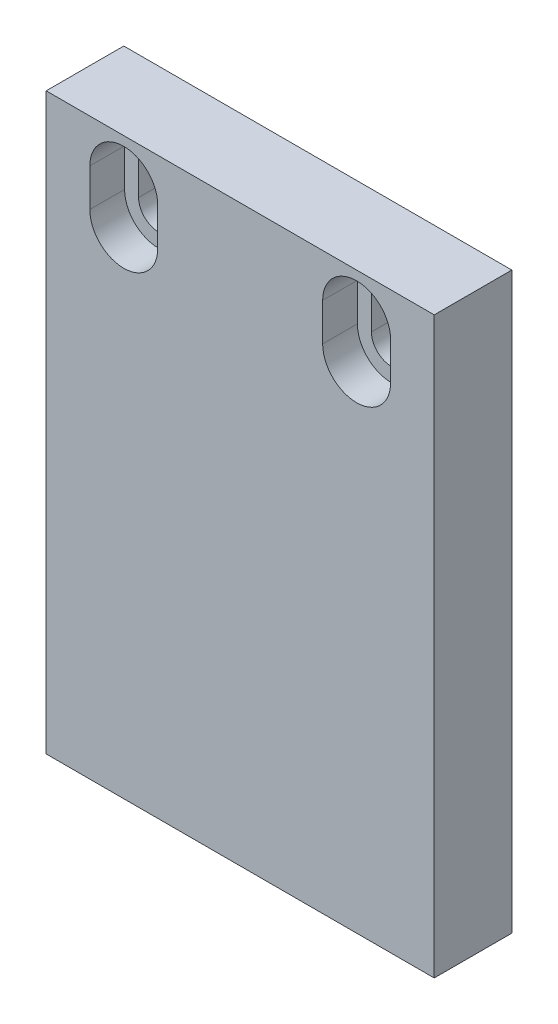
ISO-10303-21;
HEADER;
FILE_DESCRIPTION(('STEP AP214'),'2;1');
FILE_NAME('part.step','',(''),(''),'','','');
FILE_SCHEMA(('AUTOMOTIVE_DESIGN { 1 0 10303 214 1 1 1 1 }'));
ENDSEC;
DATA;
#1=APPLICATION_CONTEXT('core data for automotive mechanical design processes');
#2=APPLICATION_PROTOCOL_DEFINITION('international standard','automotive_design',2000,#1);
#3=PRODUCT_CONTEXT('',#1,'mechanical');
#4=PRODUCT('Part','Part','',(#3));
#5=PRODUCT_RELATED_PRODUCT_CATEGORY('part','',(#4));
#6=PRODUCT_DEFINITION_FORMATION('','',#4);
#7=PRODUCT_DEFINITION_CONTEXT('part definition',#1,'design');
#8=PRODUCT_DEFINITION('design','',#6,#7);
#9=PRODUCT_DEFINITION_SHAPE('','',#8);
#10=(LENGTH_UNIT() NAMED_UNIT(*) SI_UNIT(.MILLI.,.METRE.));
#11=(NAMED_UNIT(*) PLANE_ANGLE_UNIT() SI_UNIT($,.RADIAN.));
#12=(NAMED_UNIT(*) SI_UNIT($,.STERADIAN.) SOLID_ANGLE_UNIT());
#13=UNCERTAINTY_MEASURE_WITH_UNIT(LENGTH_MEASURE(1.E-05),#10,'distance_accuracy_value','');
#14=(GEOMETRIC_REPRESENTATION_CONTEXT(3) GLOBAL_UNCERTAINTY_ASSIGNED_CONTEXT((#13)) GLOBAL_UNIT_ASSIGNED_CONTEXT((#10,
#11,#12)) REPRESENTATION_CONTEXT('',''));
#15=CARTESIAN_POINT('',(0.,0.,0.));
#16=DIRECTION('',(0.,0.,1.));
#17=DIRECTION('',(1.,0.,0.));
#18=AXIS2_PLACEMENT_3D('',#15,#16,#17);
#19=CARTESIAN_POINT('',(15.875,46.99,3.175));
#20=DIRECTION('',(-1.,0.,0.));
#21=DIRECTION('',(0.,0.,1.));
#22=AXIS2_PLACEMENT_3D('',#19,#20,#21);
#23=PLANE('',#22);
#24=DIRECTION('',(0.,0.,-1.));
#25=VECTOR('',#24,1.);
#26=CARTESIAN_POINT('',(15.875,0.,3.175));
#27=LINE('',#26,#25);
#28=CARTESIAN_POINT('',(15.875,0.,3.175));
#29=VERTEX_POINT('',#28);
#30=CARTESIAN_POINT('',(15.875,0.,-3.175));
#31=VERTEX_POINT('',#30);
#32=EDGE_CURVE('E441',#29,#31,#27,.T.);
#33=ORIENTED_EDGE('',*,*,#32,.T.);
#34=DIRECTION('',(0.,-1.,0.));
#35=VECTOR('',#34,1.);
#36=CARTESIAN_POINT('',(15.875,46.99,-3.175));
#37=LINE('',#36,#35);
#38=CARTESIAN_POINT('',(15.875,46.99,-3.175));
#39=VERTEX_POINT('',#38);
#40=EDGE_CURVE('E470',#39,#31,#37,.T.);
#41=ORIENTED_EDGE('',*,*,#40,.F.);
#42=DIRECTION('',(0.,0.,-1.));
#43=VECTOR('',#42,1.);
#44=CARTESIAN_POINT('',(15.875,46.99,3.175));
#45=LINE('',#44,#43);
#46=CARTESIAN_POINT('',(15.875,46.99,3.175));
#47=VERTEX_POINT('',#46);
#48=EDGE_CURVE('E442',#47,#39,#45,.T.);
#49=ORIENTED_EDGE('',*,*,#48,.F.);
#50=DIRECTION('',(0.,-1.,0.));
#51=VECTOR('',#50,1.);
#52=CARTESIAN_POINT('',(15.875,46.99,3.175));
#53=LINE('',#52,#51);
#54=EDGE_CURVE('E454',#47,#29,#53,.T.);
#55=ORIENTED_EDGE('',*,*,#54,.T.);
#56=EDGE_LOOP('',(#33,#41,#49,#55));
#57=FACE_BOUND('',#56,.T.);
#58=ADVANCED_FACE('F185',(#57),#23,.F.);
#59=CARTESIAN_POINT('',(15.875,46.99,-3.175));
#60=DIRECTION('',(0.,0.,1.));
#61=DIRECTION('',(1.,0.,0.));
#62=AXIS2_PLACEMENT_3D('',#59,#60,#61);
#63=PLANE('',#62);
#64=CARTESIAN_POINT('',(9.525,40.36695,-3.175));
#65=DIRECTION('',(0.,0.,1.));
#66=DIRECTION('',(1.,0.,0.));
#67=AXIS2_PLACEMENT_3D('',#64,#65,#66);
#68=CIRCLE('',#67,1.63195);
#69=CARTESIAN_POINT('',(7.89305,40.36695,-3.175));
#70=VERTEX_POINT('',#69);
#71=CARTESIAN_POINT('',(11.15695,40.36695,-3.175));
#72=VERTEX_POINT('',#71);
#73=EDGE_CURVE('E192',#70,#72,#68,.T.);
#74=ORIENTED_EDGE('',*,*,#73,.T.);
#75=DIRECTION('',(0.,1.,0.));
#76=VECTOR('',#75,1.);
#77=CARTESIAN_POINT('',(11.15695,46.99,-3.175));
#78=LINE('',#77,#76);
#79=CARTESIAN_POINT('',(11.15695,43.45305,-3.175));
#80=VERTEX_POINT('',#79);
#81=EDGE_CURVE('E13',#72,#80,#78,.T.);
#82=ORIENTED_EDGE('',*,*,#81,.T.);
#83=CARTESIAN_POINT('',(9.525,43.45305,-3.175));
#84=DIRECTION('',(0.,0.,1.));
#85=DIRECTION('',(1.,0.,0.));
#86=AXIS2_PLACEMENT_3D('',#83,#84,#85);
#87=CIRCLE('',#86,1.63195);
#88=CARTESIAN_POINT('',(7.89305,43.45305,-3.175));
#89=VERTEX_POINT('',#88);
#90=EDGE_CURVE('E488',#80,#89,#87,.T.);
#91=ORIENTED_EDGE('',*,*,#90,.T.);
#92=DIRECTION('',(0.,-1.,0.));
#93=VECTOR('',#92,1.);
#94=CARTESIAN_POINT('',(7.89305,46.99,-3.175));
#95=LINE('',#94,#93);
#96=EDGE_CURVE('E485',#89,#70,#95,.T.);
#97=ORIENTED_EDGE('',*,*,#96,.T.);
#98=EDGE_LOOP('',(#74,#82,#91,#97));
#99=FACE_BOUND('',#98,.T.);
#100=CARTESIAN_POINT('',(-9.52500000000001,43.45305,-3.175));
#101=DIRECTION('',(0.,0.,1.));
#102=DIRECTION('',(1.,0.,0.));
#103=AXIS2_PLACEMENT_3D('',#100,#101,#102);
#104=CIRCLE('',#103,1.63195);
#105=CARTESIAN_POINT('',(-7.89305000000001,43.45305,-3.175));
#106=VERTEX_POINT('',#105);
#107=CARTESIAN_POINT('',(-11.15695,43.45305,-3.175));
#108=VERTEX_POINT('',#107);
#109=EDGE_CURVE('E479',#106,#108,#104,.T.);
#110=ORIENTED_EDGE('',*,*,#109,.T.);
#111=DIRECTION('',(0.,-1.,0.));
#112=VECTOR('',#111,1.);
#113=CARTESIAN_POINT('',(-11.15695,46.99,-3.175));
#114=LINE('',#113,#112);
#115=CARTESIAN_POINT('',(-11.15695,40.36695,-3.175));
#116=VERTEX_POINT('',#115);
#117=EDGE_CURVE('E482',#108,#116,#114,.T.);
#118=ORIENTED_EDGE('',*,*,#117,.T.);
#119=CARTESIAN_POINT('',(-9.52500000000001,40.36695,-3.175));
#120=DIRECTION('',(0.,0.,1.));
#121=DIRECTION('',(1.,0.,0.));
#122=AXIS2_PLACEMENT_3D('',#119,#120,#121);
#123=CIRCLE('',#122,1.63195);
#124=CARTESIAN_POINT('',(-7.89305000000001,40.36695,-3.175));
#125=VERTEX_POINT('',#124);
#126=EDGE_CURVE('E476',#116,#125,#123,.T.);
#127=ORIENTED_EDGE('',*,*,#126,.T.);
#128=DIRECTION('',(0.,1.,0.));
#129=VECTOR('',#128,1.);
#130=CARTESIAN_POINT('',(-7.89305000000001,46.99,-3.175));
#131=LINE('',#130,#129);
#132=EDGE_CURVE('E473',#125,#106,#131,.T.);
#133=ORIENTED_EDGE('',*,*,#132,.T.);
#134=EDGE_LOOP('',(#110,#118,#127,#133));
#135=FACE_BOUND('',#134,.T.);
#136=DIRECTION('',(-1.,0.,0.));
#137=VECTOR('',#136,1.);
#138=CARTESIAN_POINT('',(15.875,0.,-3.175));
#139=LINE('',#138,#137);
#140=CARTESIAN_POINT('',(-15.875,0.,-3.175));
#141=VERTEX_POINT('',#140);
#142=EDGE_CURVE('E457',#31,#141,#139,.T.);
#143=ORIENTED_EDGE('',*,*,#142,.T.);
#144=DIRECTION('',(0.,-1.,0.));
#145=VECTOR('',#144,1.);
#146=CARTESIAN_POINT('',(-15.875,46.99,-3.175));
#147=LINE('',#146,#145);
#148=CARTESIAN_POINT('',(-15.875,46.99,-3.175));
#149=VERTEX_POINT('',#148);
#150=EDGE_CURVE('E468',#149,#141,#147,.T.);
#151=ORIENTED_EDGE('',*,*,#150,.F.);
#152=DIRECTION('',(-1.,0.,0.));
#153=VECTOR('',#152,1.);
#154=CARTESIAN_POINT('',(15.875,46.99,-3.175));
#155=LINE('',#154,#153);
#156=EDGE_CURVE('E445',#39,#149,#155,.T.);
#157=ORIENTED_EDGE('',*,*,#156,.F.);
#158=ORIENTED_EDGE('',*,*,#40,.T.);
#159=EDGE_LOOP('',(#143,#151,#157,#158));
#160=FACE_BOUND('',#159,.T.);
#161=ADVANCED_FACE('F492',(#99,#135,#160),#63,.F.);
#162=CARTESIAN_POINT('',(-15.875,46.99,3.175));
#163=DIRECTION('',(-1.,0.,0.));
#164=DIRECTION('',(0.,0.,1.));
#165=AXIS2_PLACEMENT_3D('',#162,#163,#164);
#166=PLANE('',#165);
#167=DIRECTION('',(0.,0.,-1.));
#168=VECTOR('',#167,1.);
#169=CARTESIAN_POINT('',(-15.875,0.,3.175));
#170=LINE('',#169,#168);
#171=CARTESIAN_POINT('',(-15.875,0.,3.175));
#172=VERTEX_POINT('',#171);
#173=EDGE_CURVE('E460',#172,#141,#170,.T.);
#174=ORIENTED_EDGE('',*,*,#173,.F.);
#175=DIRECTION('',(0.,-1.,0.));
#176=VECTOR('',#175,1.);
#177=CARTESIAN_POINT('',(-15.875,46.99,3.175));
#178=LINE('',#177,#176);
#179=CARTESIAN_POINT('',(-15.875,46.99,3.175));
#180=VERTEX_POINT('',#179);
#181=EDGE_CURVE('E466',#180,#172,#178,.T.);
#182=ORIENTED_EDGE('',*,*,#181,.F.);
#183=DIRECTION('',(0.,0.,-1.));
#184=VECTOR('',#183,1.);
#185=CARTESIAN_POINT('',(-15.875,46.99,3.175));
#186=LINE('',#185,#184);
#187=EDGE_CURVE('E448',#180,#149,#186,.T.);
#188=ORIENTED_EDGE('',*,*,#187,.T.);
#189=ORIENTED_EDGE('',*,*,#150,.T.);
#190=EDGE_LOOP('',(#174,#182,#188,#189));
#191=FACE_BOUND('',#190,.T.);
#192=ADVANCED_FACE('F533',(#191),#166,.T.);
#193=CARTESIAN_POINT('',(15.875,46.99,3.175));
#194=DIRECTION('',(0.,0.,1.));
#195=DIRECTION('',(1.,0.,0.));
#196=AXIS2_PLACEMENT_3D('',#193,#194,#195);
#197=PLANE('',#196);
#198=DIRECTION('',(0.,1.,0.));
#199=VECTOR('',#198,1.);
#200=CARTESIAN_POINT('',(12.3037600000001,40.36695,3.175));
#201=LINE('',#200,#199);
#202=CARTESIAN_POINT('',(12.30376,40.36695,3.175));
#203=VERTEX_POINT('',#202);
#204=CARTESIAN_POINT('',(12.3037600000001,43.45305,3.175));
#205=VERTEX_POINT('',#204);
#206=EDGE_CURVE('E348',#203,#205,#201,.T.);
#207=ORIENTED_EDGE('',*,*,#206,.F.);
#208=CARTESIAN_POINT('',(9.525,40.36695,3.175));
#209=DIRECTION('',(0.,0.,1.));
#210=DIRECTION('',(1.,0.,0.));
#211=AXIS2_PLACEMENT_3D('',#208,#209,#210);
#212=CIRCLE('',#211,2.77876);
#213=CARTESIAN_POINT('',(6.74623999999996,40.36695,3.175));
#214=VERTEX_POINT('',#213);
#215=EDGE_CURVE('E337',#214,#203,#212,.T.);
#216=ORIENTED_EDGE('',*,*,#215,.F.);
#217=DIRECTION('',(0.,1.,0.));
#218=VECTOR('',#217,1.);
#219=CARTESIAN_POINT('',(6.74624,40.36695,3.175));
#220=LINE('',#219,#218);
#221=CARTESIAN_POINT('',(6.74624,43.45305,3.175));
#222=VERTEX_POINT('',#221);
#223=EDGE_CURVE('E356',#214,#222,#220,.T.);
#224=ORIENTED_EDGE('',*,*,#223,.T.);
#225=CARTESIAN_POINT('',(9.525,43.45305,3.175));
#226=DIRECTION('',(0.,0.,1.));
#227=DIRECTION('',(1.,0.,0.));
#228=AXIS2_PLACEMENT_3D('',#225,#226,#227);
#229=CIRCLE('',#228,2.77876);
#230=EDGE_CURVE('E369',#205,#222,#229,.T.);
#231=ORIENTED_EDGE('',*,*,#230,.F.);
#232=EDGE_LOOP('',(#207,#216,#224,#231));
#233=FACE_BOUND('',#232,.T.);
#234=CARTESIAN_POINT('',(-9.52500000000001,40.36695,3.175));
#235=DIRECTION('',(0.,0.,1.));
#236=DIRECTION('',(1.,0.,0.));
#237=AXIS2_PLACEMENT_3D('',#234,#235,#236);
#238=CIRCLE('',#237,2.77876);
#239=CARTESIAN_POINT('',(-12.3037600000001,40.36695,3.175));
#240=VERTEX_POINT('',#239);
#241=CARTESIAN_POINT('',(-6.74624000000001,40.36695,3.175));
#242=VERTEX_POINT('',#241);
#243=EDGE_CURVE('E403',#240,#242,#238,.T.);
#244=ORIENTED_EDGE('',*,*,#243,.F.);
#245=DIRECTION('',(0.,1.,0.));
#246=VECTOR('',#245,1.);
#247=CARTESIAN_POINT('',(-12.30376,40.36695,3.175));
#248=LINE('',#247,#246);
#249=CARTESIAN_POINT('',(-12.30376,43.45305,3.175));
#250=VERTEX_POINT('',#249);
#251=EDGE_CURVE('E391',#240,#250,#248,.T.);
#252=ORIENTED_EDGE('',*,*,#251,.T.);
#253=CARTESIAN_POINT('',(-9.52500000000001,43.45305,3.175));
#254=DIRECTION('',(0.,0.,1.));
#255=DIRECTION('',(1.,0.,0.));
#256=AXIS2_PLACEMENT_3D('',#253,#254,#255);
#257=CIRCLE('',#256,2.77876);
#258=CARTESIAN_POINT('',(-6.74624000000001,43.45305,3.175));
#259=VERTEX_POINT('',#258);
#260=EDGE_CURVE('E418',#259,#250,#257,.T.);
#261=ORIENTED_EDGE('',*,*,#260,.F.);
#262=DIRECTION('',(0.,1.,0.));
#263=VECTOR('',#262,1.);
#264=CARTESIAN_POINT('',(-6.74624000000001,40.36695,3.175));
#265=LINE('',#264,#263);
#266=EDGE_CURVE('E379',#242,#259,#265,.T.);
#267=ORIENTED_EDGE('',*,*,#266,.F.);
#268=EDGE_LOOP('',(#244,#252,#261,#267));
#269=FACE_BOUND('',#268,.T.);
#270=DIRECTION('',(-1.,0.,0.));
#271=VECTOR('',#270,1.);
#272=CARTESIAN_POINT('',(15.875,0.,3.175));
#273=LINE('',#272,#271);
#274=EDGE_CURVE('E446',#29,#172,#273,.T.);
#275=ORIENTED_EDGE('',*,*,#274,.F.);
#276=ORIENTED_EDGE('',*,*,#54,.F.);
#277=DIRECTION('',(-1.,0.,0.));
#278=VECTOR('',#277,1.);
#279=CARTESIAN_POINT('',(15.875,46.99,3.175));
#280=LINE('',#279,#278);
#281=EDGE_CURVE('E451',#47,#180,#280,.T.);
#282=ORIENTED_EDGE('',*,*,#281,.T.);
#283=ORIENTED_EDGE('',*,*,#181,.T.);
#284=EDGE_LOOP('',(#275,#276,#282,#283));
#285=FACE_BOUND('',#284,.T.);
#286=ADVANCED_FACE('F511',(#233,#269,#285),#197,.T.);
#287=CARTESIAN_POINT('',(0.,46.99,0.));
#288=DIRECTION('',(0.,1.,0.));
#289=DIRECTION('',(0.,0.,1.));
#290=AXIS2_PLACEMENT_3D('',#287,#288,#289);
#291=PLANE('',#290);
#292=ORIENTED_EDGE('',*,*,#48,.T.);
#293=ORIENTED_EDGE('',*,*,#156,.T.);
#294=ORIENTED_EDGE('',*,*,#187,.F.);
#295=ORIENTED_EDGE('',*,*,#281,.F.);
#296=EDGE_LOOP('',(#292,#293,#294,#295));
#297=FACE_BOUND('',#296,.T.);
#298=ADVANCED_FACE('F548',(#297),#291,.T.);
#299=CARTESIAN_POINT('',(0.,0.,0.));
#300=DIRECTION('',(0.,1.,0.));
#301=DIRECTION('',(0.,0.,1.));
#302=AXIS2_PLACEMENT_3D('',#299,#300,#301);
#303=PLANE('',#302);
#304=CARTESIAN_POINT('',(-9.52499999999999,0.,0.));
#305=DIRECTION('',(0.,-1.,0.));
#306=DIRECTION('',(0.,0.,-1.));
#307=AXIS2_PLACEMENT_3D('',#304,#305,#306);
#308=CIRCLE('',#307,1.1303);
#309=CARTESIAN_POINT('',(-9.52499999999999,0.,-1.1303));
#310=VERTEX_POINT('',#309);
#311=EDGE_CURVE('E429',#310,#310,#308,.T.);
#312=ORIENTED_EDGE('',*,*,#311,.F.);
#313=EDGE_LOOP('',(#312));
#314=FACE_BOUND('',#313,.T.);
#315=CARTESIAN_POINT('',(9.525,0.,0.));
#316=DIRECTION('',(0.,-1.,0.));
#317=DIRECTION('',(0.,0.,-1.));
#318=AXIS2_PLACEMENT_3D('',#315,#316,#317);
#319=CIRCLE('',#318,1.1303);
#320=CARTESIAN_POINT('',(9.525,0.,-1.1303));
#321=VERTEX_POINT('',#320);
#322=EDGE_CURVE('E435',#321,#321,#319,.T.);
#323=ORIENTED_EDGE('',*,*,#322,.F.);
#324=EDGE_LOOP('',(#323));
#325=FACE_BOUND('',#324,.T.);
#326=ORIENTED_EDGE('',*,*,#32,.F.);
#327=ORIENTED_EDGE('',*,*,#274,.T.);
#328=ORIENTED_EDGE('',*,*,#173,.T.);
#329=ORIENTED_EDGE('',*,*,#142,.F.);
#330=EDGE_LOOP('',(#326,#327,#328,#329));
#331=FACE_BOUND('',#330,.T.);
#332=ADVANCED_FACE('F539',(#314,#325,#331),#303,.F.);
#333=CARTESIAN_POINT('',(9.525,7.5946,0.));
#334=DIRECTION('',(0.,-1.,0.));
#335=DIRECTION('',(0.,0.,-1.));
#336=AXIS2_PLACEMENT_3D('',#333,#334,#335);
#337=CONICAL_SURFACE('',#336,1.1303,1.02974425867665);
#338=CARTESIAN_POINT('',(9.525,8.27375275768685,0.));
#339=VERTEX_POINT('',#338);
#340=VERTEX_LOOP('',#339);
#341=FACE_BOUND('',#340,.T.);
#342=CARTESIAN_POINT('',(9.525,7.5946,0.));
#343=DIRECTION('',(0.,-1.,0.));
#344=DIRECTION('',(0.,0.,-1.));
#345=AXIS2_PLACEMENT_3D('',#342,#343,#344);
#346=CIRCLE('',#345,1.1303);
#347=CARTESIAN_POINT('',(9.525,7.5946,-1.1303));
#348=VERTEX_POINT('',#347);
#349=EDGE_CURVE('E438',#348,#348,#346,.T.);
#350=ORIENTED_EDGE('',*,*,#349,.T.);
#351=EDGE_LOOP('',(#350));
#352=FACE_BOUND('',#351,.T.);
#353=ADVANCED_FACE('F555',(#341,#352),#337,.F.);
#354=CARTESIAN_POINT('',(9.525,0.,0.));
#355=DIRECTION('',(0.,-1.,0.));
#356=DIRECTION('',(0.,0.,-1.));
#357=AXIS2_PLACEMENT_3D('',#354,#355,#356);
#358=CYLINDRICAL_SURFACE('',#357,1.1303);
#359=ORIENTED_EDGE('',*,*,#349,.F.);
#360=EDGE_LOOP('',(#359));
#361=FACE_BOUND('',#360,.T.);
#362=ORIENTED_EDGE('',*,*,#322,.T.);
#363=EDGE_LOOP('',(#362));
#364=FACE_BOUND('',#363,.T.);
#365=ADVANCED_FACE('F743',(#361,#364),#358,.F.);
#366=CARTESIAN_POINT('',(-9.52499999999999,7.5946,0.));
#367=DIRECTION('',(0.,-1.,0.));
#368=DIRECTION('',(0.,0.,-1.));
#369=AXIS2_PLACEMENT_3D('',#366,#367,#368);
#370=CONICAL_SURFACE('',#369,1.1303,1.02974425867665);
#371=CARTESIAN_POINT('',(-9.525,8.27375275768685,0.));
#372=VERTEX_POINT('',#371);
#373=VERTEX_LOOP('',#372);
#374=FACE_BOUND('',#373,.T.);
#375=CARTESIAN_POINT('',(-9.52499999999999,7.5946,0.));
#376=DIRECTION('',(0.,-1.,0.));
#377=DIRECTION('',(0.,0.,-1.));
#378=AXIS2_PLACEMENT_3D('',#375,#376,#377);
#379=CIRCLE('',#378,1.1303);
#380=CARTESIAN_POINT('',(-9.52499999999999,7.5946,-1.1303));
#381=VERTEX_POINT('',#380);
#382=EDGE_CURVE('E432',#381,#381,#379,.T.);
#383=ORIENTED_EDGE('',*,*,#382,.T.);
#384=EDGE_LOOP('',(#383));
#385=FACE_BOUND('',#384,.T.);
#386=ADVANCED_FACE('F740',(#374,#385),#370,.F.);
#387=CARTESIAN_POINT('',(-9.52499999999999,0.,0.));
#388=DIRECTION('',(0.,-1.,0.));
#389=DIRECTION('',(0.,0.,-1.));
#390=AXIS2_PLACEMENT_3D('',#387,#388,#389);
#391=CYLINDRICAL_SURFACE('',#390,1.1303);
#392=ORIENTED_EDGE('',*,*,#382,.F.);
#393=EDGE_LOOP('',(#392));
#394=FACE_BOUND('',#393,.T.);
#395=ORIENTED_EDGE('',*,*,#311,.T.);
#396=EDGE_LOOP('',(#395));
#397=FACE_BOUND('',#396,.T.);
#398=ADVANCED_FACE('F586',(#394,#397),#391,.F.);
#399=CARTESIAN_POINT('',(-11.15695,40.36695,3.175));
#400=DIRECTION('',(-1.,0.,0.));
#401=DIRECTION('',(0.,0.,1.));
#402=AXIS2_PLACEMENT_3D('',#399,#400,#401);
#403=PLANE('',#402);
#404=DIRECTION('',(0.,0.,1.));
#405=VECTOR('',#404,1.);
#406=CARTESIAN_POINT('',(-11.15695,43.45305,3.175));
#407=LINE('',#406,#405);
#408=CARTESIAN_POINT('',(-11.15695,43.45305,0.3302));
#409=VERTEX_POINT('',#408);
#410=EDGE_CURVE('E411',#108,#409,#407,.T.);
#411=ORIENTED_EDGE('',*,*,#410,.T.);
#412=DIRECTION('',(0.,1.,0.));
#413=VECTOR('',#412,1.);
#414=CARTESIAN_POINT('',(-11.15695,40.36695,0.3302));
#415=LINE('',#414,#413);
#416=CARTESIAN_POINT('',(-11.15695,40.36695,0.3302));
#417=VERTEX_POINT('',#416);
#418=EDGE_CURVE('E386',#417,#409,#415,.T.);
#419=ORIENTED_EDGE('',*,*,#418,.F.);
#420=DIRECTION('',(0.,0.,1.));
#421=VECTOR('',#420,1.);
#422=CARTESIAN_POINT('',(-11.15695,40.36695,3.175));
#423=LINE('',#422,#421);
#424=EDGE_CURVE('E394',#417,#116,#423,.F.);
#425=ORIENTED_EDGE('',*,*,#424,.T.);
#426=ORIENTED_EDGE('',*,*,#117,.F.);
#427=EDGE_LOOP('',(#411,#419,#425,#426));
#428=FACE_BOUND('',#427,.T.);
#429=ADVANCED_FACE('F580',(#428),#403,.F.);
#430=CARTESIAN_POINT('',(-9.52500000000001,43.45305,3.175));
#431=DIRECTION('',(0.,0.,1.));
#432=DIRECTION('',(1.,0.,0.));
#433=AXIS2_PLACEMENT_3D('',#430,#431,#432);
#434=CYLINDRICAL_SURFACE('',#433,1.63195);
#435=DIRECTION('',(0.,0.,-1.));
#436=VECTOR('',#435,1.);
#437=CARTESIAN_POINT('',(-7.89305000000001,43.45305,-13.335));
#438=LINE('',#437,#436);
#439=CARTESIAN_POINT('',(-7.89305000000001,43.45305,0.3302));
#440=VERTEX_POINT('',#439);
#441=EDGE_CURVE('E416',#440,#106,#438,.T.);
#442=ORIENTED_EDGE('',*,*,#441,.F.);
#443=CARTESIAN_POINT('',(-9.52500000000001,43.45305,0.3302));
#444=DIRECTION('',(0.,0.,1.));
#445=DIRECTION('',(1.,0.,0.));
#446=AXIS2_PLACEMENT_3D('',#443,#444,#445);
#447=CIRCLE('',#446,1.63195);
#448=EDGE_CURVE('E424',#440,#409,#447,.T.);
#449=ORIENTED_EDGE('',*,*,#448,.T.);
#450=ORIENTED_EDGE('',*,*,#410,.F.);
#451=ORIENTED_EDGE('',*,*,#109,.F.);
#452=EDGE_LOOP('',(#442,#449,#450,#451));
#453=FACE_BOUND('',#452,.T.);
#454=ADVANCED_FACE('F585',(#453),#434,.F.);
#455=CARTESIAN_POINT('',(-9.52500000000001,40.36695,3.175));
#456=DIRECTION('',(0.,0.,1.));
#457=DIRECTION('',(1.,0.,0.));
#458=AXIS2_PLACEMENT_3D('',#455,#456,#457);
#459=CYLINDRICAL_SURFACE('',#458,1.63195);
#460=ORIENTED_EDGE('',*,*,#424,.F.);
#461=CARTESIAN_POINT('',(-9.52500000000001,40.36695,0.3302));
#462=DIRECTION('',(0.,0.,1.));
#463=DIRECTION('',(1.,0.,0.));
#464=AXIS2_PLACEMENT_3D('',#461,#462,#463);
#465=CIRCLE('',#464,1.63195);
#466=CARTESIAN_POINT('',(-7.89305000000001,40.36695,0.3302));
#467=VERTEX_POINT('',#466);
#468=EDGE_CURVE('E407',#417,#467,#465,.T.);
#469=ORIENTED_EDGE('',*,*,#468,.T.);
#470=DIRECTION('',(0.,0.,-1.));
#471=VECTOR('',#470,1.);
#472=CARTESIAN_POINT('',(-7.89305000000001,40.36695,-13.335));
#473=LINE('',#472,#471);
#474=EDGE_CURVE('E400',#467,#125,#473,.T.);
#475=ORIENTED_EDGE('',*,*,#474,.T.);
#476=ORIENTED_EDGE('',*,*,#126,.F.);
#477=EDGE_LOOP('',(#460,#469,#475,#476));
#478=FACE_BOUND('',#477,.T.);
#479=ADVANCED_FACE('F598',(#478),#459,.F.);
#480=CARTESIAN_POINT('',(-7.89305000000001,40.36695,-13.335));
#481=DIRECTION('',(1.,0.,0.));
#482=DIRECTION('',(0.,0.,-1.));
#483=AXIS2_PLACEMENT_3D('',#480,#481,#482);
#484=PLANE('',#483);
#485=ORIENTED_EDGE('',*,*,#474,.F.);
#486=DIRECTION('',(0.,1.,0.));
#487=VECTOR('',#486,1.);
#488=CARTESIAN_POINT('',(-7.89305000000001,40.36695,0.3302));
#489=LINE('',#488,#487);
#490=EDGE_CURVE('E384',#467,#440,#489,.T.);
#491=ORIENTED_EDGE('',*,*,#490,.T.);
#492=ORIENTED_EDGE('',*,*,#441,.T.);
#493=ORIENTED_EDGE('',*,*,#132,.F.);
#494=EDGE_LOOP('',(#485,#491,#492,#493));
#495=FACE_BOUND('',#494,.T.);
#496=ADVANCED_FACE('F608',(#495),#484,.F.);
#497=CARTESIAN_POINT('',(-7.89305000000001,43.45305,0.3302));
#498=DIRECTION('',(0.,0.,-1.));
#499=DIRECTION('',(-1.,0.,0.));
#500=AXIS2_PLACEMENT_3D('',#497,#498,#499);
#501=PLANE('',#500);
#502=DIRECTION('',(0.,1.,0.));
#503=VECTOR('',#502,1.);
#504=CARTESIAN_POINT('',(-12.30376,40.36695,0.3302));
#505=LINE('',#504,#503);
#506=CARTESIAN_POINT('',(-12.30376,40.36695,0.3302));
#507=VERTEX_POINT('',#506);
#508=CARTESIAN_POINT('',(-12.30376,43.45305,0.3302));
#509=VERTEX_POINT('',#508);
#510=EDGE_CURVE('E389',#507,#509,#505,.T.);
#511=ORIENTED_EDGE('',*,*,#510,.F.);
#512=CARTESIAN_POINT('',(-9.52500000000001,40.36695,0.3302));
#513=DIRECTION('',(0.,0.,1.));
#514=DIRECTION('',(1.,0.,0.));
#515=AXIS2_PLACEMENT_3D('',#512,#513,#514);
#516=CIRCLE('',#515,2.77876);
#517=CARTESIAN_POINT('',(-6.74624000000001,40.36695,0.3302));
#518=VERTEX_POINT('',#517);
#519=EDGE_CURVE('E405',#507,#518,#516,.T.);
#520=ORIENTED_EDGE('',*,*,#519,.T.);
#521=DIRECTION('',(0.,1.,0.));
#522=VECTOR('',#521,1.);
#523=CARTESIAN_POINT('',(-6.74624000000001,40.36695,0.3302));
#524=LINE('',#523,#522);
#525=CARTESIAN_POINT('',(-6.74624000000001,43.45305,0.3302));
#526=VERTEX_POINT('',#525);
#527=EDGE_CURVE('E382',#518,#526,#524,.T.);
#528=ORIENTED_EDGE('',*,*,#527,.T.);
#529=CARTESIAN_POINT('',(-9.52500000000001,43.45305,0.3302));
#530=DIRECTION('',(0.,0.,1.));
#531=DIRECTION('',(1.,0.,0.));
#532=AXIS2_PLACEMENT_3D('',#529,#530,#531);
#533=CIRCLE('',#532,2.77876);
#534=EDGE_CURVE('E421',#526,#509,#533,.T.);
#535=ORIENTED_EDGE('',*,*,#534,.T.);
#536=EDGE_LOOP('',(#511,#520,#528,#535));
#537=FACE_BOUND('',#536,.T.);
#538=ORIENTED_EDGE('',*,*,#448,.F.);
#539=ORIENTED_EDGE('',*,*,#490,.F.);
#540=ORIENTED_EDGE('',*,*,#468,.F.);
#541=ORIENTED_EDGE('',*,*,#418,.T.);
#542=EDGE_LOOP('',(#538,#539,#540,#541));
#543=FACE_BOUND('',#542,.T.);
#544=ADVANCED_FACE('F618',(#537,#543),#501,.F.);
#545=CARTESIAN_POINT('',(-9.52500000000001,43.45305,3.175));
#546=DIRECTION('',(0.,0.,1.));
#547=DIRECTION('',(1.,0.,0.));
#548=AXIS2_PLACEMENT_3D('',#545,#546,#547);
#549=CYLINDRICAL_SURFACE('',#548,2.77876);
#550=ORIENTED_EDGE('',*,*,#534,.F.);
#551=DIRECTION('',(0.,0.,-1.));
#552=VECTOR('',#551,1.);
#553=CARTESIAN_POINT('',(-6.74624000000001,43.45305,0.3302));
#554=LINE('',#553,#552);
#555=EDGE_CURVE('E413',#259,#526,#554,.T.);
#556=ORIENTED_EDGE('',*,*,#555,.F.);
#557=ORIENTED_EDGE('',*,*,#260,.T.);
#558=DIRECTION('',(0.,0.,1.));
#559=VECTOR('',#558,1.);
#560=CARTESIAN_POINT('',(-12.30376,43.45305,3.175));
#561=LINE('',#560,#559);
#562=EDGE_CURVE('E427',#509,#250,#561,.T.);
#563=ORIENTED_EDGE('',*,*,#562,.F.);
#564=EDGE_LOOP('',(#550,#556,#557,#563));
#565=FACE_BOUND('',#564,.T.);
#566=ADVANCED_FACE('F628',(#565),#549,.F.);
#567=CARTESIAN_POINT('',(-9.52500000000001,40.36695,3.175));
#568=DIRECTION('',(0.,0.,1.));
#569=DIRECTION('',(1.,0.,0.));
#570=AXIS2_PLACEMENT_3D('',#567,#568,#569);
#571=CYLINDRICAL_SURFACE('',#570,2.77876);
#572=ORIENTED_EDGE('',*,*,#243,.T.);
#573=DIRECTION('',(0.,0.,-1.));
#574=VECTOR('',#573,1.);
#575=CARTESIAN_POINT('',(-6.74624000000001,40.36695,0.3302));
#576=LINE('',#575,#574);
#577=EDGE_CURVE('E397',#242,#518,#576,.T.);
#578=ORIENTED_EDGE('',*,*,#577,.T.);
#579=ORIENTED_EDGE('',*,*,#519,.F.);
#580=DIRECTION('',(0.,0.,1.));
#581=VECTOR('',#580,1.);
#582=CARTESIAN_POINT('',(-12.30376,40.36695,3.175));
#583=LINE('',#582,#581);
#584=EDGE_CURVE('E409',#240,#507,#583,.F.);
#585=ORIENTED_EDGE('',*,*,#584,.F.);
#586=EDGE_LOOP('',(#572,#578,#579,#585));
#587=FACE_BOUND('',#586,.T.);
#588=ADVANCED_FACE('F638',(#587),#571,.F.);
#589=CARTESIAN_POINT('',(-12.30376,40.36695,3.175));
#590=DIRECTION('',(-1.,0.,0.));
#591=DIRECTION('',(0.,0.,1.));
#592=AXIS2_PLACEMENT_3D('',#589,#590,#591);
#593=PLANE('',#592);
#594=ORIENTED_EDGE('',*,*,#562,.T.);
#595=ORIENTED_EDGE('',*,*,#251,.F.);
#596=ORIENTED_EDGE('',*,*,#584,.T.);
#597=ORIENTED_EDGE('',*,*,#510,.T.);
#598=EDGE_LOOP('',(#594,#595,#596,#597));
#599=FACE_BOUND('',#598,.T.);
#600=ADVANCED_FACE('F648',(#599),#593,.F.);
#601=CARTESIAN_POINT('',(-6.74624000000001,40.36695,0.3302));
#602=DIRECTION('',(1.,0.,0.));
#603=DIRECTION('',(0.,0.,-1.));
#604=AXIS2_PLACEMENT_3D('',#601,#602,#603);
#605=PLANE('',#604);
#606=ORIENTED_EDGE('',*,*,#555,.T.);
#607=ORIENTED_EDGE('',*,*,#527,.F.);
#608=ORIENTED_EDGE('',*,*,#577,.F.);
#609=ORIENTED_EDGE('',*,*,#266,.T.);
#610=EDGE_LOOP('',(#606,#607,#608,#609));
#611=FACE_BOUND('',#610,.T.);
#612=ADVANCED_FACE('F658',(#611),#605,.F.);
#613=CARTESIAN_POINT('',(9.525,40.36695,3.175));
#614=DIRECTION('',(0.,0.,1.));
#615=DIRECTION('',(1.,0.,0.));
#616=AXIS2_PLACEMENT_3D('',#613,#614,#615);
#617=CYLINDRICAL_SURFACE('',#616,1.63195);
#618=DIRECTION('',(0.,0.,1.));
#619=VECTOR('',#618,1.);
#620=CARTESIAN_POINT('',(7.89305,40.36695,3.175));
#621=LINE('',#620,#619);
#622=CARTESIAN_POINT('',(7.89305,40.36695,0.3302));
#623=VERTEX_POINT('',#622);
#624=EDGE_CURVE('E199',#623,#70,#621,.F.);
#625=ORIENTED_EDGE('',*,*,#624,.F.);
#626=CARTESIAN_POINT('',(9.525,40.36695,0.3302));
#627=DIRECTION('',(0.,0.,1.));
#628=DIRECTION('',(1.,0.,0.));
#629=AXIS2_PLACEMENT_3D('',#626,#627,#628);
#630=CIRCLE('',#629,1.63195);
#631=CARTESIAN_POINT('',(11.15695,40.36695,0.3302));
#632=VERTEX_POINT('',#631);
#633=EDGE_CURVE('E336',#623,#632,#630,.T.);
#634=ORIENTED_EDGE('',*,*,#633,.T.);
#635=DIRECTION('',(0.,0.,-1.));
#636=VECTOR('',#635,1.);
#637=CARTESIAN_POINT('',(11.15695,40.36695,-13.335));
#638=LINE('',#637,#636);
#639=EDGE_CURVE('E352',#632,#72,#638,.T.);
#640=ORIENTED_EDGE('',*,*,#639,.T.);
#641=ORIENTED_EDGE('',*,*,#73,.F.);
#642=EDGE_LOOP('',(#625,#634,#640,#641));
#643=FACE_BOUND('',#642,.T.);
#644=ADVANCED_FACE('F495',(#643),#617,.F.);
#645=CARTESIAN_POINT('',(9.525,43.45305,3.175));
#646=DIRECTION('',(0.,0.,1.));
#647=DIRECTION('',(1.,0.,0.));
#648=AXIS2_PLACEMENT_3D('',#645,#646,#647);
#649=CYLINDRICAL_SURFACE('',#648,1.63195);
#650=DIRECTION('',(0.,0.,-1.));
#651=VECTOR('',#650,1.);
#652=CARTESIAN_POINT('',(11.15695,43.45305,-13.335));
#653=LINE('',#652,#651);
#654=CARTESIAN_POINT('',(11.15695,43.45305,0.3302));
#655=VERTEX_POINT('',#654);
#656=EDGE_CURVE('E366',#655,#80,#653,.T.);
#657=ORIENTED_EDGE('',*,*,#656,.F.);
#658=CARTESIAN_POINT('',(9.525,43.45305,0.3302));
#659=DIRECTION('',(0.,0.,1.));
#660=DIRECTION('',(1.,0.,0.));
#661=AXIS2_PLACEMENT_3D('',#658,#659,#660);
#662=CIRCLE('',#661,1.63195);
#663=CARTESIAN_POINT('',(7.89305,43.45305,0.3302));
#664=VERTEX_POINT('',#663);
#665=EDGE_CURVE('E374',#655,#664,#662,.T.);
#666=ORIENTED_EDGE('',*,*,#665,.T.);
#667=DIRECTION('',(0.,0.,1.));
#668=VECTOR('',#667,1.);
#669=CARTESIAN_POINT('',(7.89305,43.45305,3.175));
#670=LINE('',#669,#668);
#671=EDGE_CURVE('E363',#89,#664,#670,.T.);
#672=ORIENTED_EDGE('',*,*,#671,.F.);
#673=ORIENTED_EDGE('',*,*,#90,.F.);
#674=EDGE_LOOP('',(#657,#666,#672,#673));
#675=FACE_BOUND('',#674,.T.);
#676=ADVANCED_FACE('F677',(#675),#649,.F.);
#677=CARTESIAN_POINT('',(11.15695,40.36695,-13.335));
#678=DIRECTION('',(1.,0.,0.));
#679=DIRECTION('',(0.,0.,-1.));
#680=AXIS2_PLACEMENT_3D('',#677,#678,#679);
#681=PLANE('',#680);
#682=ORIENTED_EDGE('',*,*,#639,.F.);
#683=DIRECTION('',(0.,1.,0.));
#684=VECTOR('',#683,1.);
#685=CARTESIAN_POINT('',(11.15695,40.36695,0.3302));
#686=LINE('',#685,#684);
#687=EDGE_CURVE('E347',#632,#655,#686,.T.);
#688=ORIENTED_EDGE('',*,*,#687,.T.);
#689=ORIENTED_EDGE('',*,*,#656,.T.);
#690=ORIENTED_EDGE('',*,*,#81,.F.);
#691=EDGE_LOOP('',(#682,#688,#689,#690));
#692=FACE_BOUND('',#691,.T.);
#693=ADVANCED_FACE('F499',(#692),#681,.F.);
#694=CARTESIAN_POINT('',(7.89305,40.36695,3.175));
#695=DIRECTION('',(-1.,0.,0.));
#696=DIRECTION('',(0.,0.,1.));
#697=AXIS2_PLACEMENT_3D('',#694,#695,#696);
#698=PLANE('',#697);
#699=ORIENTED_EDGE('',*,*,#671,.T.);
#700=DIRECTION('',(0.,1.,0.));
#701=VECTOR('',#700,1.);
#702=CARTESIAN_POINT('',(7.89305,40.36695,0.3302));
#703=LINE('',#702,#701);
#704=EDGE_CURVE('E503',#623,#664,#703,.T.);
#705=ORIENTED_EDGE('',*,*,#704,.F.);
#706=ORIENTED_EDGE('',*,*,#624,.T.);
#707=ORIENTED_EDGE('',*,*,#96,.F.);
#708=EDGE_LOOP('',(#699,#705,#706,#707));
#709=FACE_BOUND('',#708,.T.);
#710=ADVANCED_FACE('F525',(#709),#698,.F.);
#711=CARTESIAN_POINT('',(11.15695,43.45305,0.3302));
#712=DIRECTION('',(0.,0.,-1.));
#713=DIRECTION('',(-1.,0.,0.));
#714=AXIS2_PLACEMENT_3D('',#711,#712,#713);
#715=PLANE('',#714);
#716=DIRECTION('',(0.,1.,0.));
#717=VECTOR('',#716,1.);
#718=CARTESIAN_POINT('',(6.74624,40.36695,0.3302));
#719=LINE('',#718,#717);
#720=CARTESIAN_POINT('',(6.74624,40.36695,0.3302));
#721=VERTEX_POINT('',#720);
#722=CARTESIAN_POINT('',(6.74624,43.45305,0.3302));
#723=VERTEX_POINT('',#722);
#724=EDGE_CURVE('E334',#721,#723,#719,.T.);
#725=ORIENTED_EDGE('',*,*,#724,.F.);
#726=CARTESIAN_POINT('',(9.525,40.36695,0.3302));
#727=DIRECTION('',(0.,0.,1.));
#728=DIRECTION('',(1.,0.,0.));
#729=AXIS2_PLACEMENT_3D('',#726,#727,#728);
#730=CIRCLE('',#729,2.77876);
#731=CARTESIAN_POINT('',(12.30376,40.36695,0.3302));
#732=VERTEX_POINT('',#731);
#733=EDGE_CURVE('E327',#721,#732,#730,.T.);
#734=ORIENTED_EDGE('',*,*,#733,.T.);
#735=DIRECTION('',(0.,1.,0.));
#736=VECTOR('',#735,1.);
#737=CARTESIAN_POINT('',(12.30376,40.36695,0.3302));
#738=LINE('',#737,#736);
#739=CARTESIAN_POINT('',(12.30376,43.45305,0.3302));
#740=VERTEX_POINT('',#739);
#741=EDGE_CURVE('E332',#732,#740,#738,.T.);
#742=ORIENTED_EDGE('',*,*,#741,.T.);
#743=CARTESIAN_POINT('',(9.525,43.45305,0.3302));
#744=DIRECTION('',(0.,0.,1.));
#745=DIRECTION('',(1.,0.,0.));
#746=AXIS2_PLACEMENT_3D('',#743,#744,#745);
#747=CIRCLE('',#746,2.77876);
#748=EDGE_CURVE('E372',#740,#723,#747,.T.);
#749=ORIENTED_EDGE('',*,*,#748,.T.);
#750=EDGE_LOOP('',(#725,#734,#742,#749));
#751=FACE_BOUND('',#750,.T.);
#752=ORIENTED_EDGE('',*,*,#665,.F.);
#753=ORIENTED_EDGE('',*,*,#687,.F.);
#754=ORIENTED_EDGE('',*,*,#633,.F.);
#755=ORIENTED_EDGE('',*,*,#704,.T.);
#756=EDGE_LOOP('',(#752,#753,#754,#755));
#757=FACE_BOUND('',#756,.T.);
#758=ADVANCED_FACE('F329',(#751,#757),#715,.F.);
#759=CARTESIAN_POINT('',(9.525,43.45305,3.175));
#760=DIRECTION('',(0.,0.,1.));
#761=DIRECTION('',(1.,0.,0.));
#762=AXIS2_PLACEMENT_3D('',#759,#760,#761);
#763=CYLINDRICAL_SURFACE('',#762,2.77876);
#764=ORIENTED_EDGE('',*,*,#748,.F.);
#765=DIRECTION('',(0.,0.,-1.));
#766=VECTOR('',#765,1.);
#767=CARTESIAN_POINT('',(12.30376,43.45305,0.3302));
#768=LINE('',#767,#766);
#769=EDGE_CURVE('E346',#205,#740,#768,.T.);
#770=ORIENTED_EDGE('',*,*,#769,.F.);
#771=ORIENTED_EDGE('',*,*,#230,.T.);
#772=DIRECTION('',(0.,0.,1.));
#773=VECTOR('',#772,1.);
#774=CARTESIAN_POINT('',(6.74624,43.45305,3.175));
#775=LINE('',#774,#773);
#776=EDGE_CURVE('E377',#723,#222,#775,.T.);
#777=ORIENTED_EDGE('',*,*,#776,.F.);
#778=EDGE_LOOP('',(#764,#770,#771,#777));
#779=FACE_BOUND('',#778,.T.);
#780=ADVANCED_FACE('F517',(#779),#763,.F.);
#781=CARTESIAN_POINT('',(9.525,40.36695,3.175));
#782=DIRECTION('',(0.,0.,1.));
#783=DIRECTION('',(1.,0.,0.));
#784=AXIS2_PLACEMENT_3D('',#781,#782,#783);
#785=CYLINDRICAL_SURFACE('',#784,2.77876);
#786=ORIENTED_EDGE('',*,*,#215,.T.);
#787=DIRECTION('',(0.,0.,-1.));
#788=VECTOR('',#787,1.);
#789=CARTESIAN_POINT('',(12.30376,40.36695,0.3302));
#790=LINE('',#789,#788);
#791=EDGE_CURVE('E343',#203,#732,#790,.T.);
#792=ORIENTED_EDGE('',*,*,#791,.T.);
#793=ORIENTED_EDGE('',*,*,#733,.F.);
#794=DIRECTION('',(0.,0.,1.));
#795=VECTOR('',#794,1.);
#796=CARTESIAN_POINT('',(6.74624,40.36695,3.175));
#797=LINE('',#796,#795);
#798=EDGE_CURVE('E207',#214,#721,#797,.F.);
#799=ORIENTED_EDGE('',*,*,#798,.F.);
#800=EDGE_LOOP('',(#786,#792,#793,#799));
#801=FACE_BOUND('',#800,.T.);
#802=ADVANCED_FACE('F350',(#801),#785,.F.);
#803=CARTESIAN_POINT('',(6.74624,40.36695,3.175));
#804=DIRECTION('',(-1.,0.,0.));
#805=DIRECTION('',(0.,0.,1.));
#806=AXIS2_PLACEMENT_3D('',#803,#804,#805);
#807=PLANE('',#806);
#808=ORIENTED_EDGE('',*,*,#776,.T.);
#809=ORIENTED_EDGE('',*,*,#223,.F.);
#810=ORIENTED_EDGE('',*,*,#798,.T.);
#811=ORIENTED_EDGE('',*,*,#724,.T.);
#812=EDGE_LOOP('',(#808,#809,#810,#811));
#813=FACE_BOUND('',#812,.T.);
#814=ADVANCED_FACE('F514',(#813),#807,.F.);
#815=CARTESIAN_POINT('',(12.30376,40.36695,0.3302));
#816=DIRECTION('',(1.,0.,0.));
#817=DIRECTION('',(0.,0.,-1.));
#818=AXIS2_PLACEMENT_3D('',#815,#816,#817);
#819=PLANE('',#818);
#820=ORIENTED_EDGE('',*,*,#769,.T.);
#821=ORIENTED_EDGE('',*,*,#741,.F.);
#822=ORIENTED_EDGE('',*,*,#791,.F.);
#823=ORIENTED_EDGE('',*,*,#206,.T.);
#824=EDGE_LOOP('',(#820,#821,#822,#823));
#825=FACE_BOUND('',#824,.T.);
#826=ADVANCED_FACE('F342',(#825),#819,.F.);
#827=CLOSED_SHELL('',(#58,#161,#192,#286,#298,#332,#353,#365,#386,#398,#429,#454,#479,#496,#544,
#566,#588,#600,#612,#644,#676,#693,#710,#758,#780,#802,#814,#826));
#828=MANIFOLD_SOLID_BREP('B2',#827);
#829=ADVANCED_BREP_SHAPE_REPRESENTATION('',(#18,#828),#14);
#830=SHAPE_DEFINITION_REPRESENTATION(#9,#829);
ENDSEC;
END-ISO-10303-21;
